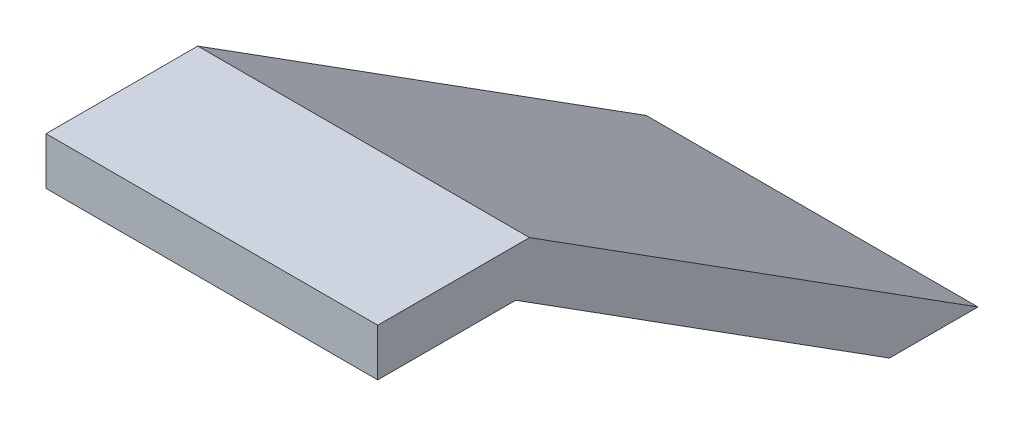
ISO-10303-21;
HEADER;
FILE_DESCRIPTION(('STEP AP214'),'2;1');
FILE_NAME('part.step','',(''),(''),'','','');
FILE_SCHEMA(('AUTOMOTIVE_DESIGN { 1 0 10303 214 1 1 1 1 }'));
ENDSEC;
DATA;
#1=APPLICATION_CONTEXT('core data for automotive mechanical design processes');
#2=APPLICATION_PROTOCOL_DEFINITION('international standard','automotive_design',2000,#1);
#3=PRODUCT_CONTEXT('',#1,'mechanical');
#4=PRODUCT('Part','Part','',(#3));
#5=PRODUCT_RELATED_PRODUCT_CATEGORY('part','',(#4));
#6=PRODUCT_DEFINITION_FORMATION('','',#4);
#7=PRODUCT_DEFINITION_CONTEXT('part definition',#1,'design');
#8=PRODUCT_DEFINITION('design','',#6,#7);
#9=PRODUCT_DEFINITION_SHAPE('','',#8);
#10=(LENGTH_UNIT() NAMED_UNIT(*) SI_UNIT(.MILLI.,.METRE.));
#11=(NAMED_UNIT(*) PLANE_ANGLE_UNIT() SI_UNIT($,.RADIAN.));
#12=(NAMED_UNIT(*) SI_UNIT($,.STERADIAN.) SOLID_ANGLE_UNIT());
#13=UNCERTAINTY_MEASURE_WITH_UNIT(LENGTH_MEASURE(1.E-05),#10,'distance_accuracy_value','');
#14=(GEOMETRIC_REPRESENTATION_CONTEXT(3) GLOBAL_UNCERTAINTY_ASSIGNED_CONTEXT((#13)) GLOBAL_UNIT_ASSIGNED_CONTEXT((#10,
#11,#12)) REPRESENTATION_CONTEXT('',''));
#15=CARTESIAN_POINT('',(0.,0.,0.));
#16=DIRECTION('',(0.,0.,1.));
#17=DIRECTION('',(1.,0.,0.));
#18=AXIS2_PLACEMENT_3D('',#15,#16,#17);
#19=CARTESIAN_POINT('',(30.,1.47718631178707,41.2832699619772));
#20=DIRECTION('',(0.,0.,-1.));
#21=DIRECTION('',(0.,1.,0.));
#22=AXIS2_PLACEMENT_3D('',#19,#20,#21);
#23=PLANE('',#22);
#24=DIRECTION('',(1.,0.,0.));
#25=VECTOR('',#24,1.);
#26=CARTESIAN_POINT('',(-35.7012285450742,-1.52281368821293,41.2832699619772));
#27=LINE('',#26,#25);
#28=CARTESIAN_POINT('',(4.50000000000001,-1.52281368821293,41.2832699619772));
#29=VERTEX_POINT('',#28);
#30=CARTESIAN_POINT('',(25.5,-1.52281368821293,41.2832699619772));
#31=VERTEX_POINT('',#30);
#32=EDGE_CURVE('E146',#29,#31,#27,.T.);
#33=ORIENTED_EDGE('',*,*,#32,.T.);
#34=DIRECTION('',(0.,-1.,0.));
#35=VECTOR('',#34,1.);
#36=CARTESIAN_POINT('',(25.5,1.47718631178707,41.2832699619772));
#37=LINE('',#36,#35);
#38=CARTESIAN_POINT('',(25.5,1.47718631178707,41.2832699619772));
#39=VERTEX_POINT('',#38);
#40=EDGE_CURVE('E138',#39,#31,#37,.T.);
#41=ORIENTED_EDGE('',*,*,#40,.F.);
#42=DIRECTION('',(-1.,0.,0.));
#43=VECTOR('',#42,1.);
#44=CARTESIAN_POINT('',(30.,1.47718631178707,41.2832699619772));
#45=LINE('',#44,#43);
#46=CARTESIAN_POINT('',(4.5,1.47718631178707,41.2832699619772));
#47=VERTEX_POINT('',#46);
#48=EDGE_CURVE('E48',#39,#47,#45,.T.);
#49=ORIENTED_EDGE('',*,*,#48,.T.);
#50=DIRECTION('',(0.,1.,0.));
#51=VECTOR('',#50,1.);
#52=CARTESIAN_POINT('',(4.5,-16.5228136882129,41.2832699619772));
#53=LINE('',#52,#51);
#54=EDGE_CURVE('E127',#29,#47,#53,.T.);
#55=ORIENTED_EDGE('',*,*,#54,.F.);
#56=EDGE_LOOP('',(#33,#41,#49,#55));
#57=FACE_BOUND('',#56,.T.);
#58=ADVANCED_FACE('F40',(#57),#23,.F.);
#59=CARTESIAN_POINT('',(25.5,0.,0.));
#60=DIRECTION('',(-1.,0.,0.));
#61=DIRECTION('',(0.,0.,1.));
#62=AXIS2_PLACEMENT_3D('',#59,#60,#61);
#63=PLANE('',#62);
#64=DIRECTION('',(0.,0.535445311375715,0.844569901503578));
#65=VECTOR('',#64,1.);
#66=CARTESIAN_POINT('',(25.5,-15.8041685310392,10.0196181808886));
#67=LINE('',#66,#65);
#68=CARTESIAN_POINT('',(25.5,-16.5228136882129,8.8860830528083));
#69=VERTEX_POINT('',#68);
#70=CARTESIAN_POINT('',(25.5,-1.52281368821293,32.5459195541393));
#71=VERTEX_POINT('',#70);
#72=EDGE_CURVE('E100',#69,#71,#67,.T.);
#73=ORIENTED_EDGE('',*,*,#72,.F.);
#74=DIRECTION('',(0.,0.,1.));
#75=VECTOR('',#74,1.);
#76=CARTESIAN_POINT('',(25.5,-16.5228136882129,0.));
#77=LINE('',#76,#75);
#78=CARTESIAN_POINT('',(25.5,-16.5228136882129,3.28326996197717));
#79=VERTEX_POINT('',#78);
#80=EDGE_CURVE('E110',#79,#69,#77,.T.);
#81=ORIENTED_EDGE('',*,*,#80,.F.);
#82=DIRECTION('',(0.,0.535445311375715,0.844569901503578));
#83=VECTOR('',#82,1.);
#84=CARTESIAN_POINT('',(25.5,-16.5228136882129,3.28326996197718));
#85=LINE('',#84,#83);
#86=CARTESIAN_POINT('',(25.5,1.47718631178707,31.6750737635743));
#87=VERTEX_POINT('',#86);
#88=EDGE_CURVE('E141',#79,#87,#85,.T.);
#89=ORIENTED_EDGE('',*,*,#88,.T.);
#90=DIRECTION('',(0.,0.,1.));
#91=VECTOR('',#90,1.);
#92=CARTESIAN_POINT('',(25.5,1.47718631178707,31.6750737635743));
#93=LINE('',#92,#91);
#94=EDGE_CURVE('E63',#87,#39,#93,.T.);
#95=ORIENTED_EDGE('',*,*,#94,.T.);
#96=ORIENTED_EDGE('',*,*,#40,.T.);
#97=DIRECTION('',(0.,0.,1.));
#98=VECTOR('',#97,1.);
#99=CARTESIAN_POINT('',(25.5,-1.52281368821293,0.));
#100=LINE('',#99,#98);
#101=EDGE_CURVE('E116',#71,#31,#100,.T.);
#102=ORIENTED_EDGE('',*,*,#101,.F.);
#103=EDGE_LOOP('',(#73,#81,#89,#95,#96,#102));
#104=FACE_BOUND('',#103,.T.);
#105=ADVANCED_FACE('F118',(#104),#63,.F.);
#106=CARTESIAN_POINT('',(4.5,0.,0.));
#107=DIRECTION('',(-1.,0.,0.));
#108=DIRECTION('',(0.,0.,1.));
#109=AXIS2_PLACEMENT_3D('',#106,#107,#108);
#110=PLANE('',#109);
#111=DIRECTION('',(0.,0.,1.));
#112=VECTOR('',#111,1.);
#113=CARTESIAN_POINT('',(4.5,-16.5228136882129,3.28326996197718));
#114=LINE('',#113,#112);
#115=CARTESIAN_POINT('',(4.5,-16.5228136882129,3.28326996197718));
#116=VERTEX_POINT('',#115);
#117=CARTESIAN_POINT('',(4.50000000000001,-16.5228136882129,8.8860830528083));
#118=VERTEX_POINT('',#117);
#119=EDGE_CURVE('E135',#116,#118,#114,.T.);
#120=ORIENTED_EDGE('',*,*,#119,.T.);
#121=DIRECTION('',(0.,0.535445311375715,0.844569901503578));
#122=VECTOR('',#121,1.);
#123=CARTESIAN_POINT('',(4.5,-15.8041685310392,10.0196181808886));
#124=LINE('',#123,#122);
#125=CARTESIAN_POINT('',(4.50000000000001,-1.52281368821293,32.5459195541393));
#126=VERTEX_POINT('',#125);
#127=EDGE_CURVE('E103',#118,#126,#124,.T.);
#128=ORIENTED_EDGE('',*,*,#127,.T.);
#129=DIRECTION('',(0.,0.,1.));
#130=VECTOR('',#129,1.);
#131=CARTESIAN_POINT('',(4.5,-1.52281368821293,0.));
#132=LINE('',#131,#130);
#133=EDGE_CURVE('E12',#126,#29,#132,.T.);
#134=ORIENTED_EDGE('',*,*,#133,.T.);
#135=ORIENTED_EDGE('',*,*,#54,.T.);
#136=DIRECTION('',(0.,0.,-1.));
#137=VECTOR('',#136,1.);
#138=CARTESIAN_POINT('',(4.5,1.47718631178707,41.2832699619772));
#139=LINE('',#138,#137);
#140=CARTESIAN_POINT('',(4.5,1.47718631178707,31.6750737635743));
#141=VERTEX_POINT('',#140);
#142=EDGE_CURVE('E55',#47,#141,#139,.T.);
#143=ORIENTED_EDGE('',*,*,#142,.T.);
#144=DIRECTION('',(0.,-0.535445311375715,-0.844569901503578));
#145=VECTOR('',#144,1.);
#146=CARTESIAN_POINT('',(4.5,1.47718631178707,31.6750737635743));
#147=LINE('',#146,#145);
#148=EDGE_CURVE('E132',#141,#116,#147,.T.);
#149=ORIENTED_EDGE('',*,*,#148,.T.);
#150=EDGE_LOOP('',(#120,#128,#134,#135,#143,#149));
#151=FACE_BOUND('',#150,.T.);
#152=ADVANCED_FACE('F165',(#151),#110,.T.);
#153=CARTESIAN_POINT('',(30.,1.47718631178707,41.2832699619772));
#154=DIRECTION('',(0.,-1.,0.));
#155=DIRECTION('',(0.,0.,-1.));
#156=AXIS2_PLACEMENT_3D('',#153,#154,#155);
#157=PLANE('',#156);
#158=ORIENTED_EDGE('',*,*,#142,.F.);
#159=ORIENTED_EDGE('',*,*,#48,.F.);
#160=ORIENTED_EDGE('',*,*,#94,.F.);
#161=DIRECTION('',(1.,0.,0.));
#162=VECTOR('',#161,1.);
#163=CARTESIAN_POINT('',(0.,1.47718631178707,31.6750737635743));
#164=LINE('',#163,#162);
#165=EDGE_CURVE('E149',#141,#87,#164,.T.);
#166=ORIENTED_EDGE('',*,*,#165,.F.);
#167=EDGE_LOOP('',(#158,#159,#160,#166));
#168=FACE_BOUND('',#167,.T.);
#169=ADVANCED_FACE('F161',(#168),#157,.F.);
#170=CARTESIAN_POINT('',(0.,1.47718631178707,31.6750737635743));
#171=DIRECTION('',(0.,-0.844569901503578,0.535445311375715));
#172=DIRECTION('',(0.,-0.535445311375715,-0.844569901503578));
#173=AXIS2_PLACEMENT_3D('',#170,#171,#172);
#174=PLANE('',#173);
#175=ORIENTED_EDGE('',*,*,#148,.F.);
#176=ORIENTED_EDGE('',*,*,#165,.T.);
#177=ORIENTED_EDGE('',*,*,#88,.F.);
#178=DIRECTION('',(1.,0.,0.));
#179=VECTOR('',#178,1.);
#180=CARTESIAN_POINT('',(0.,-16.5228136882129,3.28326996197718));
#181=LINE('',#180,#179);
#182=EDGE_CURVE('E113',#116,#79,#181,.T.);
#183=ORIENTED_EDGE('',*,*,#182,.F.);
#184=EDGE_LOOP('',(#175,#176,#177,#183));
#185=FACE_BOUND('',#184,.T.);
#186=ADVANCED_FACE('F164',(#185),#174,.F.);
#187=CARTESIAN_POINT('',(-35.7012285450742,-1.52281368821293,41.2832699619772));
#188=DIRECTION('',(0.,1.,0.));
#189=DIRECTION('',(0.,0.,1.));
#190=AXIS2_PLACEMENT_3D('',#187,#188,#189);
#191=PLANE('',#190);
#192=ORIENTED_EDGE('',*,*,#32,.F.);
#193=ORIENTED_EDGE('',*,*,#133,.F.);
#194=DIRECTION('',(1.,0.,0.));
#195=VECTOR('',#194,1.);
#196=CARTESIAN_POINT('',(-35.7012285450742,-1.52281368821293,32.5459195541393));
#197=LINE('',#196,#195);
#198=EDGE_CURVE('E107',#126,#71,#197,.T.);
#199=ORIENTED_EDGE('',*,*,#198,.T.);
#200=ORIENTED_EDGE('',*,*,#101,.T.);
#201=EDGE_LOOP('',(#192,#193,#199,#200));
#202=FACE_BOUND('',#201,.T.);
#203=ADVANCED_FACE('F168',(#202),#191,.F.);
#204=CARTESIAN_POINT('',(-35.7012285450742,-1.52281368821293,32.5459195541393));
#205=DIRECTION('',(0.,0.844569901503578,-0.535445311375715));
#206=DIRECTION('',(0.,0.535445311375715,0.844569901503578));
#207=AXIS2_PLACEMENT_3D('',#204,#205,#206);
#208=PLANE('',#207);
#209=ORIENTED_EDGE('',*,*,#198,.F.);
#210=ORIENTED_EDGE('',*,*,#127,.F.);
#211=DIRECTION('',(1.,0.,0.));
#212=VECTOR('',#211,1.);
#213=CARTESIAN_POINT('',(-35.7012285450742,-16.5228136882129,8.8860830528083));
#214=LINE('',#213,#212);
#215=EDGE_CURVE('E96',#118,#69,#214,.T.);
#216=ORIENTED_EDGE('',*,*,#215,.T.);
#217=ORIENTED_EDGE('',*,*,#72,.T.);
#218=EDGE_LOOP('',(#209,#210,#216,#217));
#219=FACE_BOUND('',#218,.T.);
#220=ADVANCED_FACE('F98',(#219),#208,.F.);
#221=CARTESIAN_POINT('',(48.,-16.5228136882129,8.8860830528083));
#222=DIRECTION('',(0.,-1.,0.));
#223=DIRECTION('',(0.,0.,-1.));
#224=AXIS2_PLACEMENT_3D('',#221,#222,#223);
#225=PLANE('',#224);
#226=ORIENTED_EDGE('',*,*,#80,.T.);
#227=ORIENTED_EDGE('',*,*,#215,.F.);
#228=ORIENTED_EDGE('',*,*,#119,.F.);
#229=ORIENTED_EDGE('',*,*,#182,.T.);
#230=EDGE_LOOP('',(#226,#227,#228,#229));
#231=FACE_BOUND('',#230,.T.);
#232=ADVANCED_FACE('F111',(#231),#225,.T.);
#233=CLOSED_SHELL('',(#58,#105,#152,#169,#186,#203,#220,#232));
#234=MANIFOLD_SOLID_BREP('B2',#233);
#235=ADVANCED_BREP_SHAPE_REPRESENTATION('',(#18,#234),#14);
#236=SHAPE_DEFINITION_REPRESENTATION(#9,#235);
ENDSEC;
END-ISO-10303-21;
